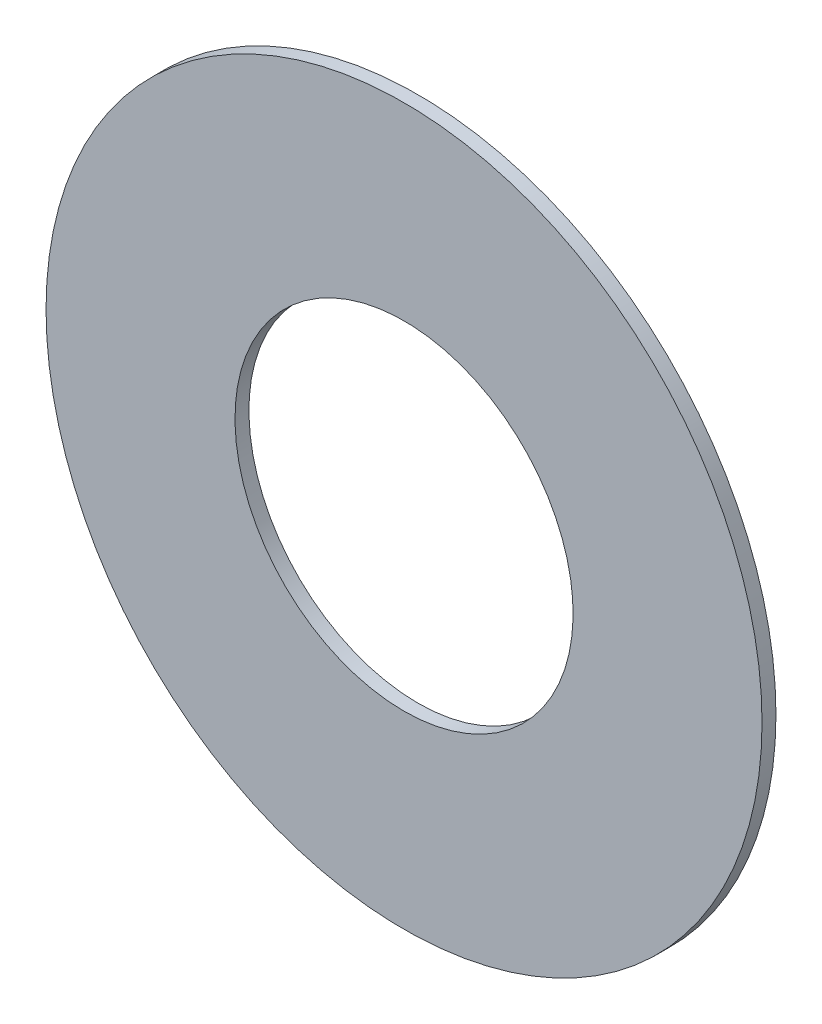
ISO-10303-21;
HEADER;
FILE_DESCRIPTION(('STEP AP214'),'2;1');
FILE_NAME('part.step','',(''),(''),'','','');
FILE_SCHEMA(('AUTOMOTIVE_DESIGN { 1 0 10303 214 1 1 1 1 }'));
ENDSEC;
DATA;
#1=APPLICATION_CONTEXT('core data for automotive mechanical design processes');
#2=APPLICATION_PROTOCOL_DEFINITION('international standard','automotive_design',2000,#1);
#3=PRODUCT_CONTEXT('',#1,'mechanical');
#4=PRODUCT('Part','Part','',(#3));
#5=PRODUCT_RELATED_PRODUCT_CATEGORY('part','',(#4));
#6=PRODUCT_DEFINITION_FORMATION('','',#4);
#7=PRODUCT_DEFINITION_CONTEXT('part definition',#1,'design');
#8=PRODUCT_DEFINITION('design','',#6,#7);
#9=PRODUCT_DEFINITION_SHAPE('','',#8);
#10=(LENGTH_UNIT() NAMED_UNIT(*) SI_UNIT(.MILLI.,.METRE.));
#11=(NAMED_UNIT(*) PLANE_ANGLE_UNIT() SI_UNIT($,.RADIAN.));
#12=(NAMED_UNIT(*) SI_UNIT($,.STERADIAN.) SOLID_ANGLE_UNIT());
#13=UNCERTAINTY_MEASURE_WITH_UNIT(LENGTH_MEASURE(1.E-05),#10,'distance_accuracy_value','');
#14=(GEOMETRIC_REPRESENTATION_CONTEXT(3) GLOBAL_UNCERTAINTY_ASSIGNED_CONTEXT((#13)) GLOBAL_UNIT_ASSIGNED_CONTEXT((#10,
#11,#12)) REPRESENTATION_CONTEXT('',''));
#15=CARTESIAN_POINT('',(0.,0.,0.));
#16=DIRECTION('',(0.,0.,1.));
#17=DIRECTION('',(1.,0.,0.));
#18=AXIS2_PLACEMENT_3D('',#15,#16,#17);
#19=CARTESIAN_POINT('',(120.645,-153.249,-0.045));
#20=DIRECTION('',(0.,0.,-1.));
#21=DIRECTION('',(0.,-1.,0.));
#22=AXIS2_PLACEMENT_3D('',#19,#20,#21);
#23=CYLINDRICAL_SURFACE('',#22,0.425);
#24=CARTESIAN_POINT('',(120.645,-153.249,1.67));
#25=DIRECTION('',(0.,0.,-1.));
#26=DIRECTION('',(0.,-1.,0.));
#27=AXIS2_PLACEMENT_3D('',#24,#25,#26);
#28=CIRCLE('',#27,0.425);
#29=CARTESIAN_POINT('',(120.645,-153.674,1.67));
#30=VERTEX_POINT('',#29);
#31=EDGE_CURVE('E20',#30,#30,#28,.T.);
#32=ORIENTED_EDGE('',*,*,#31,.T.);
#33=DIRECTION('',(0.,0.,1.));
#34=VECTOR('',#33,1.);
#35=CARTESIAN_POINT('',(120.645,-153.674,-0.045));
#36=LINE('',#35,#34);
#37=CARTESIAN_POINT('',(120.645,-153.674,1.705));
#38=VERTEX_POINT('',#37);
#39=EDGE_CURVE('E11',#30,#38,#36,.T.);
#40=ORIENTED_EDGE('',*,*,#39,.T.);
#41=CARTESIAN_POINT('',(120.645,-153.249,1.705));
#42=DIRECTION('',(0.,0.,-1.));
#43=DIRECTION('',(0.,-1.,0.));
#44=AXIS2_PLACEMENT_3D('',#41,#42,#43);
#45=CIRCLE('',#44,0.425);
#46=EDGE_CURVE('E69',#38,#38,#45,.T.);
#47=ORIENTED_EDGE('',*,*,#46,.F.);
#48=ORIENTED_EDGE('',*,*,#39,.F.);
#49=EDGE_LOOP('',(#32,#40,#47,#48));
#50=FACE_BOUND('',#49,.T.);
#51=ADVANCED_FACE('F17',(#50),#23,.F.);
#52=CARTESIAN_POINT('',(120.645,-153.249,1.67));
#53=DIRECTION('',(0.,0.,1.));
#54=DIRECTION('',(1.,0.,0.));
#55=AXIS2_PLACEMENT_3D('',#52,#53,#54);
#56=PLANE('',#55);
#57=ORIENTED_EDGE('',*,*,#31,.F.);
#58=EDGE_LOOP('',(#57));
#59=FACE_BOUND('',#58,.T.);
#60=CARTESIAN_POINT('',(120.645,-153.249,1.67));
#61=DIRECTION('',(0.,0.,1.));
#62=DIRECTION('',(1.,0.,0.));
#63=AXIS2_PLACEMENT_3D('',#60,#61,#62);
#64=CIRCLE('',#63,0.9);
#65=CARTESIAN_POINT('',(121.545,-153.249,1.67));
#66=VERTEX_POINT('',#65);
#67=EDGE_CURVE('E56',#66,#66,#64,.T.);
#68=ORIENTED_EDGE('',*,*,#67,.F.);
#69=EDGE_LOOP('',(#68));
#70=FACE_BOUND('',#69,.T.);
#71=ADVANCED_FACE('F79',(#59,#70),#56,.F.);
#72=CARTESIAN_POINT('',(120.645,-153.249,1.705));
#73=DIRECTION('',(0.,0.,1.));
#74=DIRECTION('',(1.,0.,0.));
#75=AXIS2_PLACEMENT_3D('',#72,#73,#74);
#76=PLANE('',#75);
#77=ORIENTED_EDGE('',*,*,#46,.T.);
#78=EDGE_LOOP('',(#77));
#79=FACE_BOUND('',#78,.T.);
#80=CARTESIAN_POINT('',(120.645,-153.249,1.705));
#81=DIRECTION('',(0.,0.,1.));
#82=DIRECTION('',(1.,0.,0.));
#83=AXIS2_PLACEMENT_3D('',#80,#81,#82);
#84=CIRCLE('',#83,0.9);
#85=CARTESIAN_POINT('',(121.545,-153.249,1.705));
#86=VERTEX_POINT('',#85);
#87=EDGE_CURVE('E54',#86,#86,#84,.T.);
#88=ORIENTED_EDGE('',*,*,#87,.T.);
#89=EDGE_LOOP('',(#88));
#90=FACE_BOUND('',#89,.T.);
#91=ADVANCED_FACE('F60',(#79,#90),#76,.T.);
#92=CARTESIAN_POINT('',(120.645,-153.249,1.67));
#93=DIRECTION('',(0.,0.,1.));
#94=DIRECTION('',(1.,0.,0.));
#95=AXIS2_PLACEMENT_3D('',#92,#93,#94);
#96=CYLINDRICAL_SURFACE('',#95,0.9);
#97=ORIENTED_EDGE('',*,*,#87,.F.);
#98=DIRECTION('',(0.,0.,1.));
#99=VECTOR('',#98,1.);
#100=CARTESIAN_POINT('',(121.545,-153.249,1.67));
#101=LINE('',#100,#99);
#102=EDGE_CURVE('E51',#66,#86,#101,.T.);
#103=ORIENTED_EDGE('',*,*,#102,.F.);
#104=ORIENTED_EDGE('',*,*,#67,.T.);
#105=ORIENTED_EDGE('',*,*,#102,.T.);
#106=EDGE_LOOP('',(#97,#103,#104,#105));
#107=FACE_BOUND('',#106,.T.);
#108=ADVANCED_FACE('F53',(#107),#96,.T.);
#109=CLOSED_SHELL('',(#51,#71,#91,#108));
#110=MANIFOLD_SOLID_BREP('B1',#109);
#111=ADVANCED_BREP_SHAPE_REPRESENTATION('',(#18,#110),#14);
#112=SHAPE_DEFINITION_REPRESENTATION(#9,#111);
ENDSEC;
END-ISO-10303-21;
